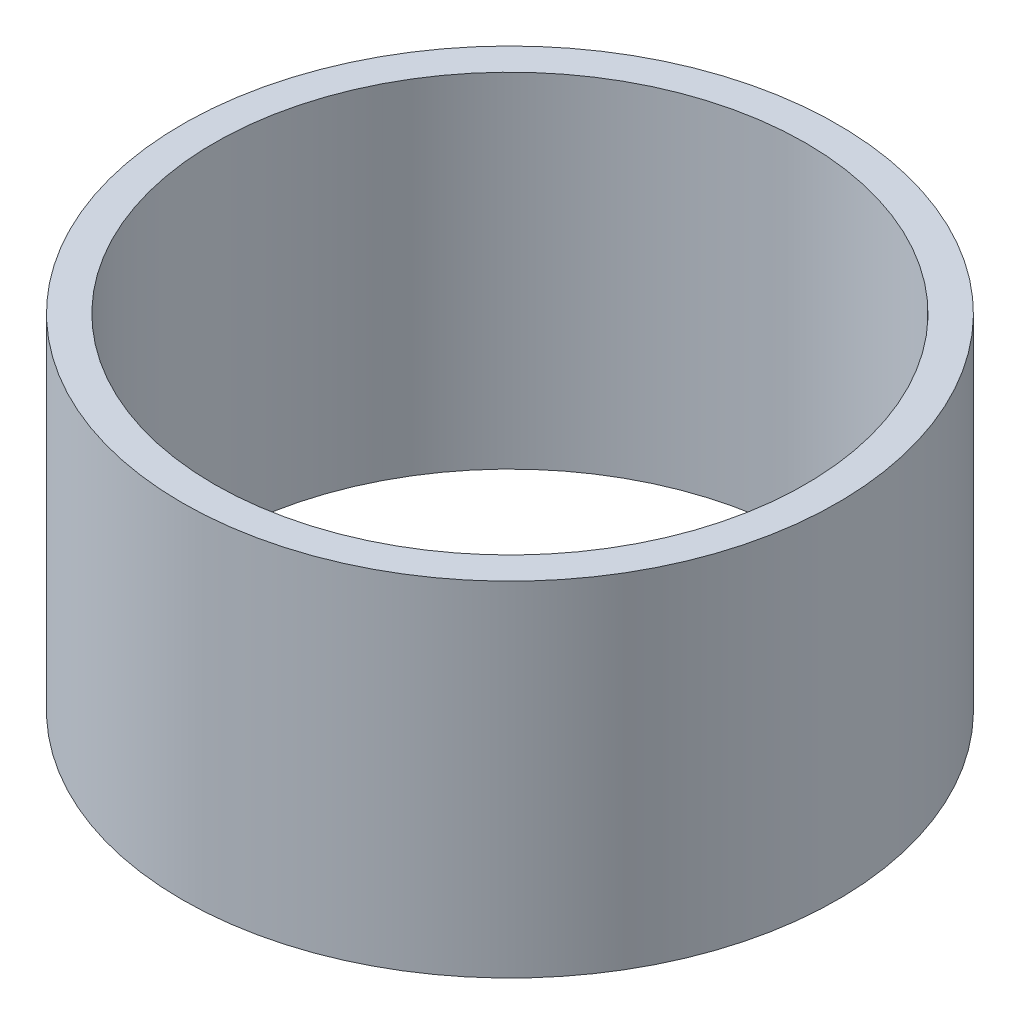
ISO-10303-21;
HEADER;
FILE_DESCRIPTION(('STEP AP214'),'2;1');
FILE_NAME('part.step','',(''),(''),'','','');
FILE_SCHEMA(('AUTOMOTIVE_DESIGN { 1 0 10303 214 1 1 1 1 }'));
ENDSEC;
DATA;
#1=APPLICATION_CONTEXT('core data for automotive mechanical design processes');
#2=APPLICATION_PROTOCOL_DEFINITION('international standard','automotive_design',2000,#1);
#3=PRODUCT_CONTEXT('',#1,'mechanical');
#4=PRODUCT('Part','Part','',(#3));
#5=PRODUCT_RELATED_PRODUCT_CATEGORY('part','',(#4));
#6=PRODUCT_DEFINITION_FORMATION('','',#4);
#7=PRODUCT_DEFINITION_CONTEXT('part definition',#1,'design');
#8=PRODUCT_DEFINITION('design','',#6,#7);
#9=PRODUCT_DEFINITION_SHAPE('','',#8);
#10=(LENGTH_UNIT() NAMED_UNIT(*) SI_UNIT(.MILLI.,.METRE.));
#11=(NAMED_UNIT(*) PLANE_ANGLE_UNIT() SI_UNIT($,.RADIAN.));
#12=(NAMED_UNIT(*) SI_UNIT($,.STERADIAN.) SOLID_ANGLE_UNIT());
#13=UNCERTAINTY_MEASURE_WITH_UNIT(LENGTH_MEASURE(1.E-05),#10,'distance_accuracy_value','');
#14=(GEOMETRIC_REPRESENTATION_CONTEXT(3) GLOBAL_UNCERTAINTY_ASSIGNED_CONTEXT((#13)) GLOBAL_UNIT_ASSIGNED_CONTEXT((#10,
#11,#12)) REPRESENTATION_CONTEXT('',''));
#15=CARTESIAN_POINT('',(0.,0.,0.));
#16=DIRECTION('',(0.,0.,1.));
#17=DIRECTION('',(1.,0.,0.));
#18=AXIS2_PLACEMENT_3D('',#15,#16,#17);
#19=CARTESIAN_POINT('',(0.,49.8130975271529,0.));
#20=DIRECTION('',(0.,-1.,0.));
#21=DIRECTION('',(0.,0.,-1.));
#22=AXIS2_PLACEMENT_3D('',#19,#20,#21);
#23=CYLINDRICAL_SURFACE('',#22,47.5);
#24=CARTESIAN_POINT('',(0.,49.8130975271529,0.));
#25=DIRECTION('',(0.,1.,0.));
#26=DIRECTION('',(0.,0.,1.));
#27=AXIS2_PLACEMENT_3D('',#24,#25,#26);
#28=CIRCLE('',#27,47.5);
#29=CARTESIAN_POINT('',(0.,49.8130975271529,47.5));
#30=VERTEX_POINT('',#29);
#31=EDGE_CURVE('E10',#30,#30,#28,.T.);
#32=ORIENTED_EDGE('',*,*,#31,.F.);
#33=EDGE_LOOP('',(#32));
#34=FACE_BOUND('',#33,.T.);
#35=CARTESIAN_POINT('',(0.,0.,0.));
#36=DIRECTION('',(0.,1.,0.));
#37=DIRECTION('',(0.,0.,1.));
#38=AXIS2_PLACEMENT_3D('',#35,#36,#37);
#39=CIRCLE('',#38,47.5);
#40=CARTESIAN_POINT('',(0.,0.,47.5));
#41=VERTEX_POINT('',#40);
#42=EDGE_CURVE('E37',#41,#41,#39,.T.);
#43=ORIENTED_EDGE('',*,*,#42,.T.);
#44=EDGE_LOOP('',(#43));
#45=FACE_BOUND('',#44,.T.);
#46=ADVANCED_FACE('F40',(#34,#45),#23,.T.);
#47=CARTESIAN_POINT('',(0.,49.8130975271529,0.));
#48=DIRECTION('',(0.,1.,0.));
#49=DIRECTION('',(0.,0.,1.));
#50=AXIS2_PLACEMENT_3D('',#47,#48,#49);
#51=PLANE('',#50);
#52=CARTESIAN_POINT('',(0.,49.8130975271529,0.));
#53=DIRECTION('',(0.,1.,0.));
#54=DIRECTION('',(0.,0.,1.));
#55=AXIS2_PLACEMENT_3D('',#52,#53,#54);
#56=CIRCLE('',#55,42.8483036727914);
#57=CARTESIAN_POINT('',(0.,49.8130975271529,42.8483036727914));
#58=VERTEX_POINT('',#57);
#59=EDGE_CURVE('E50',#58,#58,#56,.T.);
#60=ORIENTED_EDGE('',*,*,#59,.F.);
#61=EDGE_LOOP('',(#60));
#62=FACE_BOUND('',#61,.T.);
#63=ORIENTED_EDGE('',*,*,#31,.T.);
#64=EDGE_LOOP('',(#63));
#65=FACE_BOUND('',#64,.T.);
#66=ADVANCED_FACE('F59',(#62,#65),#51,.T.);
#67=CARTESIAN_POINT('',(0.,0.,0.));
#68=DIRECTION('',(0.,1.,0.));
#69=DIRECTION('',(0.,0.,1.));
#70=AXIS2_PLACEMENT_3D('',#67,#68,#69);
#71=PLANE('',#70);
#72=CARTESIAN_POINT('',(0.,0.,0.));
#73=DIRECTION('',(0.,1.,0.));
#74=DIRECTION('',(0.,0.,1.));
#75=AXIS2_PLACEMENT_3D('',#72,#73,#74);
#76=CIRCLE('',#75,42.8483036727914);
#77=CARTESIAN_POINT('',(0.,0.,42.8483036727914));
#78=VERTEX_POINT('',#77);
#79=EDGE_CURVE('E47',#78,#78,#76,.T.);
#80=ORIENTED_EDGE('',*,*,#79,.T.);
#81=EDGE_LOOP('',(#80));
#82=FACE_BOUND('',#81,.T.);
#83=ORIENTED_EDGE('',*,*,#42,.F.);
#84=EDGE_LOOP('',(#83));
#85=FACE_BOUND('',#84,.T.);
#86=ADVANCED_FACE('F58',(#82,#85),#71,.F.);
#87=CARTESIAN_POINT('',(0.,49.8130975271529,0.));
#88=DIRECTION('',(0.,-1.,0.));
#89=DIRECTION('',(0.,0.,-1.));
#90=AXIS2_PLACEMENT_3D('',#87,#88,#89);
#91=CYLINDRICAL_SURFACE('',#90,42.8483036727914);
#92=ORIENTED_EDGE('',*,*,#59,.T.);
#93=EDGE_LOOP('',(#92));
#94=FACE_BOUND('',#93,.T.);
#95=ORIENTED_EDGE('',*,*,#79,.F.);
#96=EDGE_LOOP('',(#95));
#97=FACE_BOUND('',#96,.T.);
#98=ADVANCED_FACE('F54',(#94,#97),#91,.F.);
#99=CLOSED_SHELL('',(#46,#66,#86,#98));
#100=MANIFOLD_SOLID_BREP('B2',#99);
#101=ADVANCED_BREP_SHAPE_REPRESENTATION('',(#18,#100),#14);
#102=SHAPE_DEFINITION_REPRESENTATION(#9,#101);
ENDSEC;
END-ISO-10303-21;
